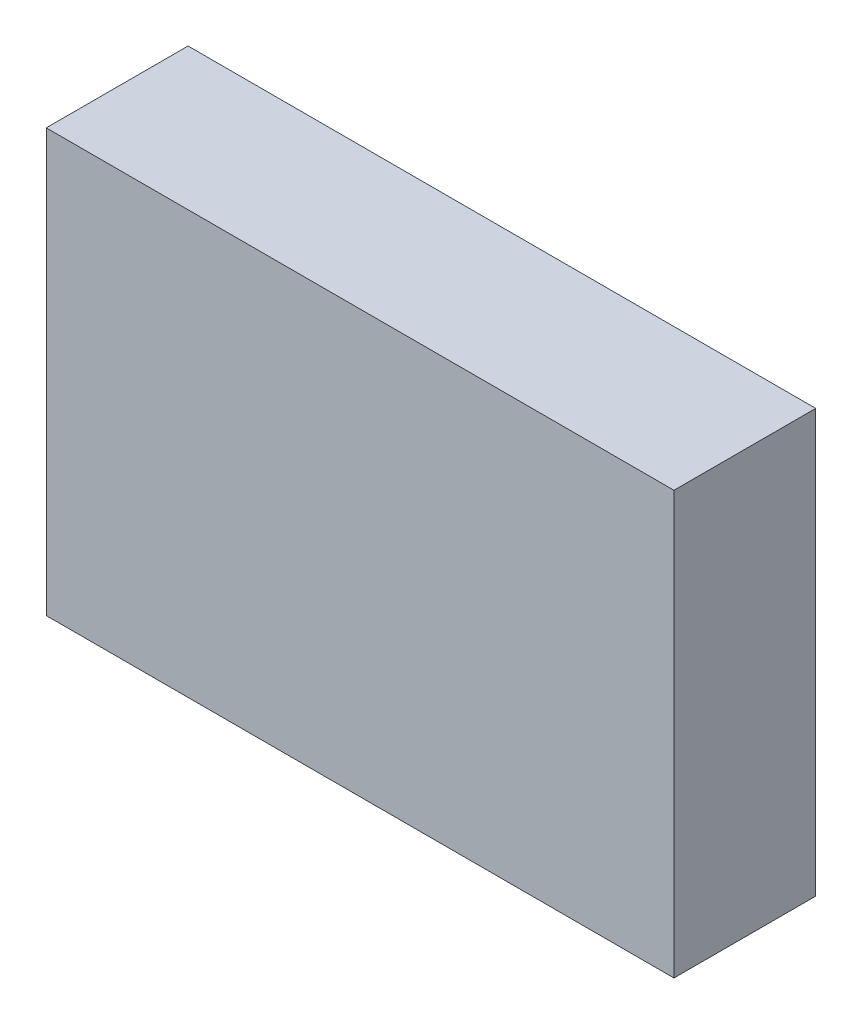
ISO-10303-21;
HEADER;
FILE_DESCRIPTION(('STEP AP214'),'2;1');
FILE_NAME('part.step','',(''),(''),'','','');
FILE_SCHEMA(('AUTOMOTIVE_DESIGN { 1 0 10303 214 1 1 1 1 }'));
ENDSEC;
DATA;
#1=APPLICATION_CONTEXT('core data for automotive mechanical design processes');
#2=APPLICATION_PROTOCOL_DEFINITION('international standard','automotive_design',2000,#1);
#3=PRODUCT_CONTEXT('',#1,'mechanical');
#4=PRODUCT('Part','Part','',(#3));
#5=PRODUCT_RELATED_PRODUCT_CATEGORY('part','',(#4));
#6=PRODUCT_DEFINITION_FORMATION('','',#4);
#7=PRODUCT_DEFINITION_CONTEXT('part definition',#1,'design');
#8=PRODUCT_DEFINITION('design','',#6,#7);
#9=PRODUCT_DEFINITION_SHAPE('','',#8);
#10=(LENGTH_UNIT() NAMED_UNIT(*) SI_UNIT(.MILLI.,.METRE.));
#11=(NAMED_UNIT(*) PLANE_ANGLE_UNIT() SI_UNIT($,.RADIAN.));
#12=(NAMED_UNIT(*) SI_UNIT($,.STERADIAN.) SOLID_ANGLE_UNIT());
#13=UNCERTAINTY_MEASURE_WITH_UNIT(LENGTH_MEASURE(1.E-05),#10,'distance_accuracy_value','');
#14=(GEOMETRIC_REPRESENTATION_CONTEXT(3) GLOBAL_UNCERTAINTY_ASSIGNED_CONTEXT((#13)) GLOBAL_UNIT_ASSIGNED_CONTEXT((#10,
#11,#12)) REPRESENTATION_CONTEXT('',''));
#15=CARTESIAN_POINT('',(0.,0.,0.));
#16=DIRECTION('',(0.,0.,1.));
#17=DIRECTION('',(1.,0.,0.));
#18=AXIS2_PLACEMENT_3D('',#15,#16,#17);
#19=CARTESIAN_POINT('',(-0.0625,-0.715,0.49));
#20=DIRECTION('',(0.,0.,1.));
#21=DIRECTION('',(1.,0.,0.));
#22=AXIS2_PLACEMENT_3D('',#19,#20,#21);
#23=PLANE('',#22);
#24=DIRECTION('',(0.,1.,0.));
#25=VECTOR('',#24,1.);
#26=CARTESIAN_POINT('',(2.0625,-0.715,0.49));
#27=LINE('',#26,#25);
#28=CARTESIAN_POINT('',(2.0625,0.715,0.49));
#29=VERTEX_POINT('',#28);
#30=CARTESIAN_POINT('',(2.0625,-0.715,0.49));
#31=VERTEX_POINT('',#30);
#32=EDGE_CURVE('E76',#29,#31,#27,.F.);
#33=ORIENTED_EDGE('',*,*,#32,.F.);
#34=DIRECTION('',(1.,0.,0.));
#35=VECTOR('',#34,1.);
#36=CARTESIAN_POINT('',(-0.0625,0.715,0.49));
#37=LINE('',#36,#35);
#38=CARTESIAN_POINT('',(-0.0625,0.715,0.49));
#39=VERTEX_POINT('',#38);
#40=EDGE_CURVE('E58',#39,#29,#37,.T.);
#41=ORIENTED_EDGE('',*,*,#40,.F.);
#42=DIRECTION('',(0.,1.,0.));
#43=VECTOR('',#42,1.);
#44=CARTESIAN_POINT('',(-0.0625,-0.715,0.49));
#45=LINE('',#44,#43);
#46=CARTESIAN_POINT('',(-0.0625,-0.715,0.49));
#47=VERTEX_POINT('',#46);
#48=EDGE_CURVE('E20',#39,#47,#45,.F.);
#49=ORIENTED_EDGE('',*,*,#48,.T.);
#50=DIRECTION('',(1.,0.,0.));
#51=VECTOR('',#50,1.);
#52=CARTESIAN_POINT('',(-0.0625,-0.715,0.49));
#53=LINE('',#52,#51);
#54=EDGE_CURVE('E55',#47,#31,#53,.T.);
#55=ORIENTED_EDGE('',*,*,#54,.T.);
#56=EDGE_LOOP('',(#33,#41,#49,#55));
#57=FACE_BOUND('',#56,.T.);
#58=ADVANCED_FACE('F17',(#57),#23,.T.);
#59=CARTESIAN_POINT('',(-0.0625,-0.715,0.01));
#60=DIRECTION('',(1.,0.,0.));
#61=DIRECTION('',(0.,0.,-1.));
#62=AXIS2_PLACEMENT_3D('',#59,#60,#61);
#63=PLANE('',#62);
#64=DIRECTION('',(0.,0.,1.));
#65=VECTOR('',#64,1.);
#66=CARTESIAN_POINT('',(-0.0625,0.715,0.01));
#67=LINE('',#66,#65);
#68=CARTESIAN_POINT('',(-0.0625,0.715,0.01));
#69=VERTEX_POINT('',#68);
#70=EDGE_CURVE('E78',#69,#39,#67,.T.);
#71=ORIENTED_EDGE('',*,*,#70,.F.);
#72=DIRECTION('',(0.,1.,0.));
#73=VECTOR('',#72,1.);
#74=CARTESIAN_POINT('',(-0.0625,-0.715,0.01));
#75=LINE('',#74,#73);
#76=CARTESIAN_POINT('',(-0.0625,-0.715,0.01));
#77=VERTEX_POINT('',#76);
#78=EDGE_CURVE('E73',#69,#77,#75,.F.);
#79=ORIENTED_EDGE('',*,*,#78,.T.);
#80=DIRECTION('',(0.,0.,1.));
#81=VECTOR('',#80,1.);
#82=CARTESIAN_POINT('',(-0.0625,-0.715,0.01));
#83=LINE('',#82,#81);
#84=EDGE_CURVE('E63',#77,#47,#83,.T.);
#85=ORIENTED_EDGE('',*,*,#84,.T.);
#86=ORIENTED_EDGE('',*,*,#48,.F.);
#87=EDGE_LOOP('',(#71,#79,#85,#86));
#88=FACE_BOUND('',#87,.T.);
#89=ADVANCED_FACE('F72',(#88),#63,.F.);
#90=CARTESIAN_POINT('',(-0.0625,-0.715,0.01));
#91=DIRECTION('',(0.,1.,0.));
#92=DIRECTION('',(0.,0.,1.));
#93=AXIS2_PLACEMENT_3D('',#90,#91,#92);
#94=PLANE('',#93);
#95=ORIENTED_EDGE('',*,*,#54,.F.);
#96=ORIENTED_EDGE('',*,*,#84,.F.);
#97=DIRECTION('',(1.,0.,0.));
#98=VECTOR('',#97,1.);
#99=CARTESIAN_POINT('',(-0.0625,-0.715,0.01));
#100=LINE('',#99,#98);
#101=CARTESIAN_POINT('',(2.0625,-0.715,0.01));
#102=VERTEX_POINT('',#101);
#103=EDGE_CURVE('E83',#77,#102,#100,.T.);
#104=ORIENTED_EDGE('',*,*,#103,.T.);
#105=DIRECTION('',(0.,0.,-1.));
#106=VECTOR('',#105,1.);
#107=CARTESIAN_POINT('',(2.0625,-0.715,0.01));
#108=LINE('',#107,#106);
#109=EDGE_CURVE('E69',#31,#102,#108,.T.);
#110=ORIENTED_EDGE('',*,*,#109,.F.);
#111=EDGE_LOOP('',(#95,#96,#104,#110));
#112=FACE_BOUND('',#111,.T.);
#113=ADVANCED_FACE('F66',(#112),#94,.F.);
#114=CARTESIAN_POINT('',(2.0625,-0.715,0.01));
#115=DIRECTION('',(1.,0.,0.));
#116=DIRECTION('',(0.,0.,-1.));
#117=AXIS2_PLACEMENT_3D('',#114,#115,#116);
#118=PLANE('',#117);
#119=DIRECTION('',(0.,0.,1.));
#120=VECTOR('',#119,1.);
#121=CARTESIAN_POINT('',(2.0625,0.715,0.01));
#122=LINE('',#121,#120);
#123=CARTESIAN_POINT('',(2.0625,0.715,0.01));
#124=VERTEX_POINT('',#123);
#125=EDGE_CURVE('E34',#29,#124,#122,.F.);
#126=ORIENTED_EDGE('',*,*,#125,.F.);
#127=ORIENTED_EDGE('',*,*,#32,.T.);
#128=ORIENTED_EDGE('',*,*,#109,.T.);
#129=DIRECTION('',(0.,1.,0.));
#130=VECTOR('',#129,1.);
#131=CARTESIAN_POINT('',(2.0625,-0.715,0.01));
#132=LINE('',#131,#130);
#133=EDGE_CURVE('E26',#102,#124,#132,.T.);
#134=ORIENTED_EDGE('',*,*,#133,.T.);
#135=EDGE_LOOP('',(#126,#127,#128,#134));
#136=FACE_BOUND('',#135,.T.);
#137=ADVANCED_FACE('F88',(#136),#118,.T.);
#138=CARTESIAN_POINT('',(-0.0625,0.715,0.01));
#139=DIRECTION('',(0.,1.,0.));
#140=DIRECTION('',(0.,0.,1.));
#141=AXIS2_PLACEMENT_3D('',#138,#139,#140);
#142=PLANE('',#141);
#143=ORIENTED_EDGE('',*,*,#40,.T.);
#144=ORIENTED_EDGE('',*,*,#125,.T.);
#145=DIRECTION('',(1.,0.,0.));
#146=VECTOR('',#145,1.);
#147=CARTESIAN_POINT('',(-0.0625,0.715,0.01));
#148=LINE('',#147,#146);
#149=EDGE_CURVE('E11',#124,#69,#148,.F.);
#150=ORIENTED_EDGE('',*,*,#149,.T.);
#151=ORIENTED_EDGE('',*,*,#70,.T.);
#152=EDGE_LOOP('',(#143,#144,#150,#151));
#153=FACE_BOUND('',#152,.T.);
#154=ADVANCED_FACE('F91',(#153),#142,.T.);
#155=CARTESIAN_POINT('',(-0.0625,-0.715,0.01));
#156=DIRECTION('',(0.,0.,1.));
#157=DIRECTION('',(1.,0.,0.));
#158=AXIS2_PLACEMENT_3D('',#155,#156,#157);
#159=PLANE('',#158);
#160=ORIENTED_EDGE('',*,*,#133,.F.);
#161=ORIENTED_EDGE('',*,*,#103,.F.);
#162=ORIENTED_EDGE('',*,*,#78,.F.);
#163=ORIENTED_EDGE('',*,*,#149,.F.);
#164=EDGE_LOOP('',(#160,#161,#162,#163));
#165=FACE_BOUND('',#164,.T.);
#166=ADVANCED_FACE('F90',(#165),#159,.F.);
#167=CLOSED_SHELL('',(#58,#89,#113,#137,#154,#166));
#168=MANIFOLD_SOLID_BREP('B1',#167);
#169=ADVANCED_BREP_SHAPE_REPRESENTATION('',(#18,#168),#14);
#170=SHAPE_DEFINITION_REPRESENTATION(#9,#169);
ENDSEC;
END-ISO-10303-21;
